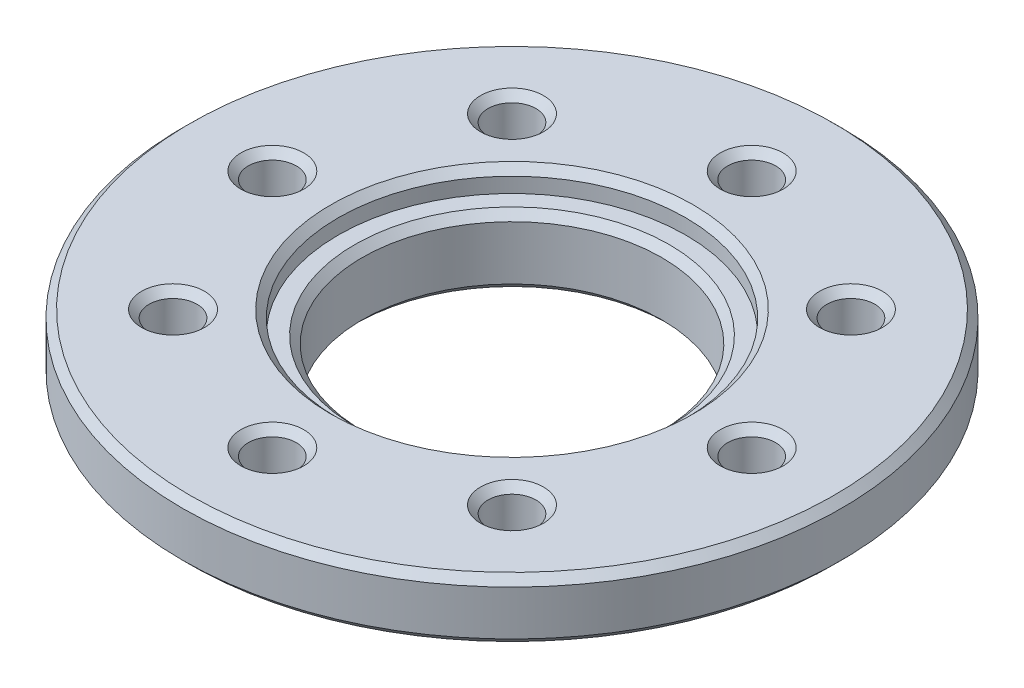
ISO-10303-21;
HEADER;
FILE_DESCRIPTION(('STEP AP214'),'2;1');
FILE_NAME('part.step','',(''),(''),'','','');
FILE_SCHEMA(('AUTOMOTIVE_DESIGN { 1 0 10303 214 1 1 1 1 }'));
ENDSEC;
DATA;
#1=APPLICATION_CONTEXT('core data for automotive mechanical design processes');
#2=APPLICATION_PROTOCOL_DEFINITION('international standard','automotive_design',2000,#1);
#3=PRODUCT_CONTEXT('',#1,'mechanical');
#4=PRODUCT('Part','Part','',(#3));
#5=PRODUCT_RELATED_PRODUCT_CATEGORY('part','',(#4));
#6=PRODUCT_DEFINITION_FORMATION('','',#4);
#7=PRODUCT_DEFINITION_CONTEXT('part definition',#1,'design');
#8=PRODUCT_DEFINITION('design','',#6,#7);
#9=PRODUCT_DEFINITION_SHAPE('','',#8);
#10=(LENGTH_UNIT() NAMED_UNIT(*) SI_UNIT(.MILLI.,.METRE.));
#11=(NAMED_UNIT(*) PLANE_ANGLE_UNIT() SI_UNIT($,.RADIAN.));
#12=(NAMED_UNIT(*) SI_UNIT($,.STERADIAN.) SOLID_ANGLE_UNIT());
#13=UNCERTAINTY_MEASURE_WITH_UNIT(LENGTH_MEASURE(1.E-05),#10,'distance_accuracy_value','');
#14=(GEOMETRIC_REPRESENTATION_CONTEXT(3) GLOBAL_UNCERTAINTY_ASSIGNED_CONTEXT((#13)) GLOBAL_UNIT_ASSIGNED_CONTEXT((#10,
#11,#12)) REPRESENTATION_CONTEXT('',''));
#15=CARTESIAN_POINT('',(0.,0.,0.));
#16=DIRECTION('',(0.,0.,1.));
#17=DIRECTION('',(1.,0.,0.));
#18=AXIS2_PLACEMENT_3D('',#15,#16,#17);
#19=CARTESIAN_POINT('',(0.,-2.,0.));
#20=DIRECTION('',(0.,-1.,0.));
#21=DIRECTION('',(0.,0.,-1.));
#22=AXIS2_PLACEMENT_3D('',#19,#20,#21);
#23=PLANE('',#22);
#24=CARTESIAN_POINT('',(0.,-2.,0.));
#25=DIRECTION('',(0.,-1.,0.));
#26=DIRECTION('',(0.,0.,-1.));
#27=AXIS2_PLACEMENT_3D('',#24,#25,#26);
#28=CIRCLE('',#27,10.7499999999956);
#29=CARTESIAN_POINT('',(0.,-2.,-10.7499999999956));
#30=VERTEX_POINT('',#29);
#31=EDGE_CURVE('E70',#30,#30,#28,.T.);
#32=ORIENTED_EDGE('',*,*,#31,.T.);
#33=EDGE_LOOP('',(#32));
#34=FACE_BOUND('',#33,.T.);
#35=CARTESIAN_POINT('',(0.,-2.,-8.));
#36=DIRECTION('',(0.,-1.,0.));
#37=DIRECTION('',(0.,0.,-1.));
#38=AXIS2_PLACEMENT_3D('',#35,#36,#37);
#39=CIRCLE('',#38,0.799999999999988);
#40=CARTESIAN_POINT('',(0.,-2.,-8.79999999999999));
#41=VERTEX_POINT('',#40);
#42=EDGE_CURVE('E125',#41,#41,#39,.T.);
#43=ORIENTED_EDGE('',*,*,#42,.F.);
#44=EDGE_LOOP('',(#43));
#45=FACE_BOUND('',#44,.T.);
#46=CARTESIAN_POINT('',(5.656854249492,-2.,-5.656854249492));
#47=DIRECTION('',(0.,-1.,0.));
#48=DIRECTION('',(0.,0.,-1.));
#49=AXIS2_PLACEMENT_3D('',#46,#47,#48);
#50=CIRCLE('',#49,0.799999999999988);
#51=CARTESIAN_POINT('',(5.656854249492,-2.,-6.45685424949199));
#52=VERTEX_POINT('',#51);
#53=EDGE_CURVE('E128',#52,#52,#50,.T.);
#54=ORIENTED_EDGE('',*,*,#53,.F.);
#55=EDGE_LOOP('',(#54));
#56=FACE_BOUND('',#55,.T.);
#57=CARTESIAN_POINT('',(8.,-2.,0.));
#58=DIRECTION('',(0.,-1.,0.));
#59=DIRECTION('',(0.,0.,-1.));
#60=AXIS2_PLACEMENT_3D('',#57,#58,#59);
#61=CIRCLE('',#60,0.799999999999988);
#62=CARTESIAN_POINT('',(8.,-2.,-0.799999999999988));
#63=VERTEX_POINT('',#62);
#64=EDGE_CURVE('E147',#63,#63,#61,.T.);
#65=ORIENTED_EDGE('',*,*,#64,.F.);
#66=EDGE_LOOP('',(#65));
#67=FACE_BOUND('',#66,.T.);
#68=CARTESIAN_POINT('',(5.656854249492,-2.,5.656854249492));
#69=DIRECTION('',(0.,-1.,0.));
#70=DIRECTION('',(0.,0.,-1.));
#71=AXIS2_PLACEMENT_3D('',#68,#69,#70);
#72=CIRCLE('',#71,0.799999999999988);
#73=CARTESIAN_POINT('',(5.656854249492,-2.,4.85685424949201));
#74=VERTEX_POINT('',#73);
#75=EDGE_CURVE('E144',#74,#74,#72,.T.);
#76=ORIENTED_EDGE('',*,*,#75,.F.);
#77=EDGE_LOOP('',(#76));
#78=FACE_BOUND('',#77,.T.);
#79=CARTESIAN_POINT('',(0.,-2.,8.));
#80=DIRECTION('',(0.,-1.,0.));
#81=DIRECTION('',(0.,0.,-1.));
#82=AXIS2_PLACEMENT_3D('',#79,#80,#81);
#83=CIRCLE('',#82,0.799999999999988);
#84=CARTESIAN_POINT('',(0.,-2.,7.20000000000001));
#85=VERTEX_POINT('',#84);
#86=EDGE_CURVE('E141',#85,#85,#83,.T.);
#87=ORIENTED_EDGE('',*,*,#86,.F.);
#88=EDGE_LOOP('',(#87));
#89=FACE_BOUND('',#88,.T.);
#90=CARTESIAN_POINT('',(-5.656854249492,-2.,5.656854249492));
#91=DIRECTION('',(0.,-1.,0.));
#92=DIRECTION('',(0.,0.,-1.));
#93=AXIS2_PLACEMENT_3D('',#90,#91,#92);
#94=CIRCLE('',#93,0.799999999999988);
#95=CARTESIAN_POINT('',(-5.656854249492,-2.,4.85685424949201));
#96=VERTEX_POINT('',#95);
#97=EDGE_CURVE('E138',#96,#96,#94,.T.);
#98=ORIENTED_EDGE('',*,*,#97,.F.);
#99=EDGE_LOOP('',(#98));
#100=FACE_BOUND('',#99,.T.);
#101=CARTESIAN_POINT('',(-8.,-2.,0.));
#102=DIRECTION('',(0.,-1.,0.));
#103=DIRECTION('',(0.,0.,-1.));
#104=AXIS2_PLACEMENT_3D('',#101,#102,#103);
#105=CIRCLE('',#104,0.799999999999988);
#106=CARTESIAN_POINT('',(-8.,-2.,-0.799999999999988));
#107=VERTEX_POINT('',#106);
#108=EDGE_CURVE('E135',#107,#107,#105,.T.);
#109=ORIENTED_EDGE('',*,*,#108,.F.);
#110=EDGE_LOOP('',(#109));
#111=FACE_BOUND('',#110,.T.);
#112=CARTESIAN_POINT('',(-5.656854249492,-2.,-5.656854249492));
#113=DIRECTION('',(0.,-1.,0.));
#114=DIRECTION('',(0.,0.,-1.));
#115=AXIS2_PLACEMENT_3D('',#112,#113,#114);
#116=CIRCLE('',#115,0.799999999999988);
#117=CARTESIAN_POINT('',(-5.656854249492,-2.,-6.45685424949199));
#118=VERTEX_POINT('',#117);
#119=EDGE_CURVE('E132',#118,#118,#116,.T.);
#120=ORIENTED_EDGE('',*,*,#119,.F.);
#121=EDGE_LOOP('',(#120));
#122=FACE_BOUND('',#121,.T.);
#123=CARTESIAN_POINT('',(0.,-2.,0.));
#124=DIRECTION('',(0.,-1.,0.));
#125=DIRECTION('',(0.,0.,-1.));
#126=AXIS2_PLACEMENT_3D('',#123,#124,#125);
#127=CIRCLE('',#126,6.25);
#128=CARTESIAN_POINT('',(0.,-2.,-6.25));
#129=VERTEX_POINT('',#128);
#130=EDGE_CURVE('E124',#129,#129,#127,.T.);
#131=ORIENTED_EDGE('',*,*,#130,.F.);
#132=EDGE_LOOP('',(#131));
#133=FACE_BOUND('',#132,.T.);
#134=ADVANCED_FACE('F32',(#34,#45,#56,#67,#78,#89,#100,#111,#122,#133),#23,.T.);
#135=CARTESIAN_POINT('',(0.,0.,0.));
#136=DIRECTION('',(0.,-1.,0.));
#137=DIRECTION('',(0.,0.,-1.));
#138=AXIS2_PLACEMENT_3D('',#135,#136,#137);
#139=CYLINDRICAL_SURFACE('',#138,11.);
#140=CARTESIAN_POINT('',(0.,-1.75000000005246,0.));
#141=DIRECTION('',(0.,-1.,0.));
#142=DIRECTION('',(0.,0.,-1.));
#143=AXIS2_PLACEMENT_3D('',#140,#141,#142);
#144=CIRCLE('',#143,11.);
#145=CARTESIAN_POINT('',(0.,-1.75000000005246,-11.));
#146=VERTEX_POINT('',#145);
#147=EDGE_CURVE('E64',#146,#146,#144,.F.);
#148=ORIENTED_EDGE('',*,*,#147,.T.);
#149=EDGE_LOOP('',(#148));
#150=FACE_BOUND('',#149,.T.);
#151=CARTESIAN_POINT('',(0.,-0.250000000004393,0.));
#152=DIRECTION('',(0.,1.,0.));
#153=DIRECTION('',(0.,0.,1.));
#154=AXIS2_PLACEMENT_3D('',#151,#152,#153);
#155=CIRCLE('',#154,11.);
#156=CARTESIAN_POINT('',(0.,-0.250000000004393,11.));
#157=VERTEX_POINT('',#156);
#158=EDGE_CURVE('E67',#157,#157,#155,.F.);
#159=ORIENTED_EDGE('',*,*,#158,.T.);
#160=EDGE_LOOP('',(#159));
#161=FACE_BOUND('',#160,.T.);
#162=ADVANCED_FACE('F172',(#150,#161),#139,.T.);
#163=CARTESIAN_POINT('',(11.,0.,0.));
#164=DIRECTION('',(0.,1.,0.));
#165=DIRECTION('',(0.,0.,1.));
#166=AXIS2_PLACEMENT_3D('',#163,#164,#165);
#167=PLANE('',#166);
#168=CARTESIAN_POINT('',(8.,0.,0.));
#169=DIRECTION('',(0.,1.,0.));
#170=DIRECTION('',(0.,0.,1.));
#171=AXIS2_PLACEMENT_3D('',#168,#169,#170);
#172=CIRCLE('',#171,1.04999999994754);
#173=CARTESIAN_POINT('',(8.,0.,1.04999999994754));
#174=VERTEX_POINT('',#173);
#175=EDGE_CURVE('E91',#174,#174,#172,.F.);
#176=ORIENTED_EDGE('',*,*,#175,.T.);
#177=EDGE_LOOP('',(#176));
#178=FACE_BOUND('',#177,.T.);
#179=CARTESIAN_POINT('',(-8.,0.,0.));
#180=DIRECTION('',(0.,1.,0.));
#181=DIRECTION('',(0.,0.,1.));
#182=AXIS2_PLACEMENT_3D('',#179,#180,#181);
#183=CIRCLE('',#182,1.04999999994754);
#184=CARTESIAN_POINT('',(-8.,0.,1.04999999994754));
#185=VERTEX_POINT('',#184);
#186=EDGE_CURVE('E94',#185,#185,#183,.F.);
#187=ORIENTED_EDGE('',*,*,#186,.T.);
#188=EDGE_LOOP('',(#187));
#189=FACE_BOUND('',#188,.T.);
#190=CARTESIAN_POINT('',(0.,0.,8.));
#191=DIRECTION('',(0.,1.,0.));
#192=DIRECTION('',(0.,0.,1.));
#193=AXIS2_PLACEMENT_3D('',#190,#191,#192);
#194=CIRCLE('',#193,1.04999999994754);
#195=CARTESIAN_POINT('',(0.,0.,9.04999999994754));
#196=VERTEX_POINT('',#195);
#197=EDGE_CURVE('E97',#196,#196,#194,.F.);
#198=ORIENTED_EDGE('',*,*,#197,.T.);
#199=EDGE_LOOP('',(#198));
#200=FACE_BOUND('',#199,.T.);
#201=CARTESIAN_POINT('',(0.,0.,0.));
#202=DIRECTION('',(0.,1.,0.));
#203=DIRECTION('',(0.,0.,1.));
#204=AXIS2_PLACEMENT_3D('',#201,#202,#203);
#205=CIRCLE('',#204,6.04999999994754);
#206=CARTESIAN_POINT('',(0.,0.,6.04999999994754));
#207=VERTEX_POINT('',#206);
#208=EDGE_CURVE('E100',#207,#207,#205,.F.);
#209=ORIENTED_EDGE('',*,*,#208,.T.);
#210=EDGE_LOOP('',(#209));
#211=FACE_BOUND('',#210,.T.);
#212=CARTESIAN_POINT('',(5.656854249492,0.,5.656854249492));
#213=DIRECTION('',(0.,1.,0.));
#214=DIRECTION('',(0.,0.,1.));
#215=AXIS2_PLACEMENT_3D('',#212,#213,#214);
#216=CIRCLE('',#215,1.04999999994754);
#217=CARTESIAN_POINT('',(5.656854249492,0.,6.70685424943954));
#218=VERTEX_POINT('',#217);
#219=EDGE_CURVE('E103',#218,#218,#216,.F.);
#220=ORIENTED_EDGE('',*,*,#219,.T.);
#221=EDGE_LOOP('',(#220));
#222=FACE_BOUND('',#221,.T.);
#223=CARTESIAN_POINT('',(0.,0.,0.));
#224=DIRECTION('',(0.,1.,0.));
#225=DIRECTION('',(0.,0.,1.));
#226=AXIS2_PLACEMENT_3D('',#223,#224,#225);
#227=CIRCLE('',#226,10.7500000000524);
#228=CARTESIAN_POINT('',(0.,0.,10.7500000000524));
#229=VERTEX_POINT('',#228);
#230=EDGE_CURVE('E106',#229,#229,#227,.T.);
#231=ORIENTED_EDGE('',*,*,#230,.T.);
#232=EDGE_LOOP('',(#231));
#233=FACE_BOUND('',#232,.T.);
#234=CARTESIAN_POINT('',(-5.656854249492,0.,5.656854249492));
#235=DIRECTION('',(0.,1.,0.));
#236=DIRECTION('',(0.,0.,1.));
#237=AXIS2_PLACEMENT_3D('',#234,#235,#236);
#238=CIRCLE('',#237,1.04999999994754);
#239=CARTESIAN_POINT('',(-5.656854249492,0.,6.70685424943954));
#240=VERTEX_POINT('',#239);
#241=EDGE_CURVE('E109',#240,#240,#238,.F.);
#242=ORIENTED_EDGE('',*,*,#241,.T.);
#243=EDGE_LOOP('',(#242));
#244=FACE_BOUND('',#243,.T.);
#245=CARTESIAN_POINT('',(-5.656854249492,0.,-5.656854249492));
#246=DIRECTION('',(0.,1.,0.));
#247=DIRECTION('',(0.,0.,1.));
#248=AXIS2_PLACEMENT_3D('',#245,#246,#247);
#249=CIRCLE('',#248,1.04999999994754);
#250=CARTESIAN_POINT('',(-5.656854249492,0.,-4.60685424954446));
#251=VERTEX_POINT('',#250);
#252=EDGE_CURVE('E112',#251,#251,#249,.F.);
#253=ORIENTED_EDGE('',*,*,#252,.T.);
#254=EDGE_LOOP('',(#253));
#255=FACE_BOUND('',#254,.T.);
#256=CARTESIAN_POINT('',(0.,0.,-8.));
#257=DIRECTION('',(0.,1.,0.));
#258=DIRECTION('',(0.,0.,1.));
#259=AXIS2_PLACEMENT_3D('',#256,#257,#258);
#260=CIRCLE('',#259,1.04999999994754);
#261=CARTESIAN_POINT('',(0.,0.,-6.95000000005246));
#262=VERTEX_POINT('',#261);
#263=EDGE_CURVE('E115',#262,#262,#260,.F.);
#264=ORIENTED_EDGE('',*,*,#263,.T.);
#265=EDGE_LOOP('',(#264));
#266=FACE_BOUND('',#265,.T.);
#267=CARTESIAN_POINT('',(5.656854249492,0.,-5.656854249492));
#268=DIRECTION('',(0.,1.,0.));
#269=DIRECTION('',(0.,0.,1.));
#270=AXIS2_PLACEMENT_3D('',#267,#268,#269);
#271=CIRCLE('',#270,1.04999999994754);
#272=CARTESIAN_POINT('',(5.656854249492,0.,-4.60685424954446));
#273=VERTEX_POINT('',#272);
#274=EDGE_CURVE('E118',#273,#273,#271,.F.);
#275=ORIENTED_EDGE('',*,*,#274,.T.);
#276=EDGE_LOOP('',(#275));
#277=FACE_BOUND('',#276,.T.);
#278=ADVANCED_FACE('F178',(#178,#189,#200,#211,#222,#233,#244,#255,#266,#277),#167,.T.);
#279=CARTESIAN_POINT('',(0.,-3.05,0.));
#280=DIRECTION('',(0.,1.,0.));
#281=DIRECTION('',(0.,0.,1.));
#282=AXIS2_PLACEMENT_3D('',#279,#280,#281);
#283=CYLINDRICAL_SURFACE('',#282,6.25);
#284=CARTESIAN_POINT('',(0.,-2.80000000005244,0.));
#285=DIRECTION('',(0.,-1.,0.));
#286=DIRECTION('',(0.,0.,-1.));
#287=AXIS2_PLACEMENT_3D('',#284,#285,#286);
#288=CIRCLE('',#287,6.25);
#289=CARTESIAN_POINT('',(0.,-2.80000000005244,-6.25));
#290=VERTEX_POINT('',#289);
#291=EDGE_CURVE('E52',#290,#290,#288,.F.);
#292=ORIENTED_EDGE('',*,*,#291,.T.);
#293=EDGE_LOOP('',(#292));
#294=FACE_BOUND('',#293,.T.);
#295=ORIENTED_EDGE('',*,*,#130,.T.);
#296=EDGE_LOOP('',(#295));
#297=FACE_BOUND('',#296,.T.);
#298=ADVANCED_FACE('F184',(#294,#297),#283,.T.);
#299=CARTESIAN_POINT('',(0.,-3.05,0.));
#300=DIRECTION('',(0.,-1.,0.));
#301=DIRECTION('',(0.,0.,-1.));
#302=AXIS2_PLACEMENT_3D('',#299,#300,#301);
#303=PLANE('',#302);
#304=CARTESIAN_POINT('',(0.,-3.05,0.));
#305=DIRECTION('',(0.,-1.,0.));
#306=DIRECTION('',(0.,0.,-1.));
#307=AXIS2_PLACEMENT_3D('',#304,#305,#306);
#308=CIRCLE('',#307,5.25000000000441);
#309=CARTESIAN_POINT('',(0.,-3.05,-5.25000000000441));
#310=VERTEX_POINT('',#309);
#311=EDGE_CURVE('E79',#310,#310,#308,.F.);
#312=ORIENTED_EDGE('',*,*,#311,.T.);
#313=EDGE_LOOP('',(#312));
#314=FACE_BOUND('',#313,.T.);
#315=CARTESIAN_POINT('',(0.,-3.05,0.));
#316=DIRECTION('',(0.,-1.,0.));
#317=DIRECTION('',(0.,0.,-1.));
#318=AXIS2_PLACEMENT_3D('',#315,#316,#317);
#319=CIRCLE('',#318,5.9999999999956);
#320=CARTESIAN_POINT('',(0.,-3.05,-5.9999999999956));
#321=VERTEX_POINT('',#320);
#322=EDGE_CURVE('E82',#321,#321,#319,.T.);
#323=ORIENTED_EDGE('',*,*,#322,.T.);
#324=EDGE_LOOP('',(#323));
#325=FACE_BOUND('',#324,.T.);
#326=ADVANCED_FACE('F276',(#314,#325),#303,.T.);
#327=CARTESIAN_POINT('',(-5.656854249492,0.,-5.656854249492));
#328=DIRECTION('',(0.,1.,0.));
#329=DIRECTION('',(0.,0.,1.));
#330=AXIS2_PLACEMENT_3D('',#327,#328,#329);
#331=CYLINDRICAL_SURFACE('',#330,0.799999999999988);
#332=CARTESIAN_POINT('',(-5.656854249492,-0.250000000004392,-5.656854249492));
#333=DIRECTION('',(0.,1.,0.));
#334=DIRECTION('',(0.,0.,1.));
#335=AXIS2_PLACEMENT_3D('',#332,#333,#334);
#336=CIRCLE('',#335,0.799999999999988);
#337=CARTESIAN_POINT('',(-5.656854249492,-0.250000000004392,-4.85685424949201));
#338=VERTEX_POINT('',#337);
#339=EDGE_CURVE('E47',#338,#338,#336,.T.);
#340=ORIENTED_EDGE('',*,*,#339,.T.);
#341=EDGE_LOOP('',(#340));
#342=FACE_BOUND('',#341,.T.);
#343=ORIENTED_EDGE('',*,*,#119,.T.);
#344=EDGE_LOOP('',(#343));
#345=FACE_BOUND('',#344,.T.);
#346=ADVANCED_FACE('F273',(#342,#345),#331,.F.);
#347=CARTESIAN_POINT('',(-8.,0.,0.));
#348=DIRECTION('',(0.,1.,0.));
#349=DIRECTION('',(0.,0.,1.));
#350=AXIS2_PLACEMENT_3D('',#347,#348,#349);
#351=CYLINDRICAL_SURFACE('',#350,0.799999999999988);
#352=CARTESIAN_POINT('',(-8.,-0.250000000004392,0.));
#353=DIRECTION('',(0.,1.,0.));
#354=DIRECTION('',(0.,0.,1.));
#355=AXIS2_PLACEMENT_3D('',#352,#353,#354);
#356=CIRCLE('',#355,0.799999999999988);
#357=CARTESIAN_POINT('',(-8.,-0.250000000004392,0.799999999999988));
#358=VERTEX_POINT('',#357);
#359=EDGE_CURVE('E88',#358,#358,#356,.T.);
#360=ORIENTED_EDGE('',*,*,#359,.T.);
#361=EDGE_LOOP('',(#360));
#362=FACE_BOUND('',#361,.T.);
#363=ORIENTED_EDGE('',*,*,#108,.T.);
#364=EDGE_LOOP('',(#363));
#365=FACE_BOUND('',#364,.T.);
#366=ADVANCED_FACE('F269',(#362,#365),#351,.F.);
#367=CARTESIAN_POINT('',(-5.656854249492,0.,5.656854249492));
#368=DIRECTION('',(0.,1.,0.));
#369=DIRECTION('',(0.,0.,1.));
#370=AXIS2_PLACEMENT_3D('',#367,#368,#369);
#371=CYLINDRICAL_SURFACE('',#370,0.799999999999988);
#372=CARTESIAN_POINT('',(-5.656854249492,-0.250000000004392,5.656854249492));
#373=DIRECTION('',(0.,1.,0.));
#374=DIRECTION('',(0.,0.,1.));
#375=AXIS2_PLACEMENT_3D('',#372,#373,#374);
#376=CIRCLE('',#375,0.799999999999988);
#377=CARTESIAN_POINT('',(-5.656854249492,-0.250000000004392,6.45685424949199));
#378=VERTEX_POINT('',#377);
#379=EDGE_CURVE('E55',#378,#378,#376,.T.);
#380=ORIENTED_EDGE('',*,*,#379,.T.);
#381=EDGE_LOOP('',(#380));
#382=FACE_BOUND('',#381,.T.);
#383=ORIENTED_EDGE('',*,*,#97,.T.);
#384=EDGE_LOOP('',(#383));
#385=FACE_BOUND('',#384,.T.);
#386=ADVANCED_FACE('F265',(#382,#385),#371,.F.);
#387=CARTESIAN_POINT('',(0.,0.,8.));
#388=DIRECTION('',(0.,1.,0.));
#389=DIRECTION('',(0.,0.,1.));
#390=AXIS2_PLACEMENT_3D('',#387,#388,#389);
#391=CYLINDRICAL_SURFACE('',#390,0.799999999999988);
#392=CARTESIAN_POINT('',(0.,-0.250000000004392,8.));
#393=DIRECTION('',(0.,1.,0.));
#394=DIRECTION('',(0.,0.,1.));
#395=AXIS2_PLACEMENT_3D('',#392,#393,#394);
#396=CIRCLE('',#395,0.799999999999988);
#397=CARTESIAN_POINT('',(0.,-0.250000000004392,8.79999999999999));
#398=VERTEX_POINT('',#397);
#399=EDGE_CURVE('E85',#398,#398,#396,.T.);
#400=ORIENTED_EDGE('',*,*,#399,.T.);
#401=EDGE_LOOP('',(#400));
#402=FACE_BOUND('',#401,.T.);
#403=ORIENTED_EDGE('',*,*,#86,.T.);
#404=EDGE_LOOP('',(#403));
#405=FACE_BOUND('',#404,.T.);
#406=ADVANCED_FACE('F261',(#402,#405),#391,.F.);
#407=CARTESIAN_POINT('',(5.656854249492,0.,5.656854249492));
#408=DIRECTION('',(0.,1.,0.));
#409=DIRECTION('',(0.,0.,1.));
#410=AXIS2_PLACEMENT_3D('',#407,#408,#409);
#411=CYLINDRICAL_SURFACE('',#410,0.799999999999988);
#412=CARTESIAN_POINT('',(5.656854249492,-0.250000000004392,5.656854249492));
#413=DIRECTION('',(0.,1.,0.));
#414=DIRECTION('',(0.,0.,1.));
#415=AXIS2_PLACEMENT_3D('',#412,#413,#414);
#416=CIRCLE('',#415,0.799999999999988);
#417=CARTESIAN_POINT('',(5.656854249492,-0.250000000004392,6.45685424949199));
#418=VERTEX_POINT('',#417);
#419=EDGE_CURVE('E58',#418,#418,#416,.T.);
#420=ORIENTED_EDGE('',*,*,#419,.T.);
#421=EDGE_LOOP('',(#420));
#422=FACE_BOUND('',#421,.T.);
#423=ORIENTED_EDGE('',*,*,#75,.T.);
#424=EDGE_LOOP('',(#423));
#425=FACE_BOUND('',#424,.T.);
#426=ADVANCED_FACE('F257',(#422,#425),#411,.F.);
#427=CARTESIAN_POINT('',(8.,0.,0.));
#428=DIRECTION('',(0.,1.,0.));
#429=DIRECTION('',(0.,0.,1.));
#430=AXIS2_PLACEMENT_3D('',#427,#428,#429);
#431=CYLINDRICAL_SURFACE('',#430,0.799999999999988);
#432=CARTESIAN_POINT('',(8.,-0.250000000004392,0.));
#433=DIRECTION('',(0.,1.,0.));
#434=DIRECTION('',(0.,0.,1.));
#435=AXIS2_PLACEMENT_3D('',#432,#433,#434);
#436=CIRCLE('',#435,0.799999999999988);
#437=CARTESIAN_POINT('',(8.,-0.250000000004392,0.799999999999988));
#438=VERTEX_POINT('',#437);
#439=EDGE_CURVE('E121',#438,#438,#436,.T.);
#440=ORIENTED_EDGE('',*,*,#439,.T.);
#441=EDGE_LOOP('',(#440));
#442=FACE_BOUND('',#441,.T.);
#443=ORIENTED_EDGE('',*,*,#64,.T.);
#444=EDGE_LOOP('',(#443));
#445=FACE_BOUND('',#444,.T.);
#446=ADVANCED_FACE('F254',(#442,#445),#431,.F.);
#447=CARTESIAN_POINT('',(5.656854249492,0.,-5.656854249492));
#448=DIRECTION('',(0.,1.,0.));
#449=DIRECTION('',(0.,0.,1.));
#450=AXIS2_PLACEMENT_3D('',#447,#448,#449);
#451=CYLINDRICAL_SURFACE('',#450,0.799999999999988);
#452=CARTESIAN_POINT('',(5.656854249492,-0.250000000004392,-5.656854249492));
#453=DIRECTION('',(0.,1.,0.));
#454=DIRECTION('',(0.,0.,1.));
#455=AXIS2_PLACEMENT_3D('',#452,#453,#454);
#456=CIRCLE('',#455,0.799999999999988);
#457=CARTESIAN_POINT('',(5.656854249492,-0.250000000004392,-4.85685424949201));
#458=VERTEX_POINT('',#457);
#459=EDGE_CURVE('E10',#458,#458,#456,.T.);
#460=ORIENTED_EDGE('',*,*,#459,.T.);
#461=EDGE_LOOP('',(#460));
#462=FACE_BOUND('',#461,.T.);
#463=ORIENTED_EDGE('',*,*,#53,.T.);
#464=EDGE_LOOP('',(#463));
#465=FACE_BOUND('',#464,.T.);
#466=ADVANCED_FACE('F248',(#462,#465),#451,.F.);
#467=CARTESIAN_POINT('',(0.,0.,-8.));
#468=DIRECTION('',(0.,1.,0.));
#469=DIRECTION('',(0.,0.,1.));
#470=AXIS2_PLACEMENT_3D('',#467,#468,#469);
#471=CYLINDRICAL_SURFACE('',#470,0.799999999999988);
#472=CARTESIAN_POINT('',(0.,-0.250000000004392,-8.));
#473=DIRECTION('',(0.,1.,0.));
#474=DIRECTION('',(0.,0.,1.));
#475=AXIS2_PLACEMENT_3D('',#472,#473,#474);
#476=CIRCLE('',#475,0.799999999999988);
#477=CARTESIAN_POINT('',(0.,-0.250000000004392,-7.20000000000001));
#478=VERTEX_POINT('',#477);
#479=EDGE_CURVE('E43',#478,#478,#476,.T.);
#480=ORIENTED_EDGE('',*,*,#479,.T.);
#481=EDGE_LOOP('',(#480));
#482=FACE_BOUND('',#481,.T.);
#483=ORIENTED_EDGE('',*,*,#42,.T.);
#484=EDGE_LOOP('',(#483));
#485=FACE_BOUND('',#484,.T.);
#486=ADVANCED_FACE('F242',(#482,#485),#471,.F.);
#487=CARTESIAN_POINT('',(0.,0.,0.));
#488=DIRECTION('',(0.,1.,0.));
#489=DIRECTION('',(0.,0.,1.));
#490=AXIS2_PLACEMENT_3D('',#487,#488,#489);
#491=CYLINDRICAL_SURFACE('',#490,5.00000000000001);
#492=CARTESIAN_POINT('',(0.,-2.80000000005244,0.));
#493=DIRECTION('',(0.,-1.,0.));
#494=DIRECTION('',(0.,0.,-1.));
#495=AXIS2_PLACEMENT_3D('',#492,#493,#494);
#496=CIRCLE('',#495,5.00000000000001);
#497=CARTESIAN_POINT('',(0.,-2.80000000005244,-5.00000000000001));
#498=VERTEX_POINT('',#497);
#499=EDGE_CURVE('E73',#498,#498,#496,.T.);
#500=ORIENTED_EDGE('',*,*,#499,.T.);
#501=EDGE_LOOP('',(#500));
#502=FACE_BOUND('',#501,.T.);
#503=CARTESIAN_POINT('',(0.,-1.00000000000439,0.));
#504=DIRECTION('',(0.,-1.,0.));
#505=DIRECTION('',(0.,0.,-1.));
#506=AXIS2_PLACEMENT_3D('',#503,#504,#505);
#507=CIRCLE('',#506,5.00000000000001);
#508=CARTESIAN_POINT('',(0.,-1.00000000000439,-5.00000000000001));
#509=VERTEX_POINT('',#508);
#510=EDGE_CURVE('E76',#509,#509,#507,.F.);
#511=ORIENTED_EDGE('',*,*,#510,.T.);
#512=EDGE_LOOP('',(#511));
#513=FACE_BOUND('',#512,.T.);
#514=ADVANCED_FACE('F169',(#502,#513),#491,.F.);
#515=CARTESIAN_POINT('',(5.00000000000001,-0.750000000000001,0.));
#516=DIRECTION('',(0.,-1.,0.));
#517=DIRECTION('',(0.,0.,-1.));
#518=AXIS2_PLACEMENT_3D('',#515,#516,#517);
#519=PLANE('',#518);
#520=CARTESIAN_POINT('',(0.,-0.750000000000001,0.));
#521=DIRECTION('',(0.,-1.,0.));
#522=DIRECTION('',(0.,0.,-1.));
#523=AXIS2_PLACEMENT_3D('',#520,#521,#522);
#524=CIRCLE('',#523,5.24999999994756);
#525=CARTESIAN_POINT('',(0.,-0.750000000000001,-5.24999999994756));
#526=VERTEX_POINT('',#525);
#527=EDGE_CURVE('E39',#526,#526,#524,.T.);
#528=ORIENTED_EDGE('',*,*,#527,.T.);
#529=EDGE_LOOP('',(#528));
#530=FACE_BOUND('',#529,.T.);
#531=CARTESIAN_POINT('',(0.,-0.750000000000001,0.));
#532=DIRECTION('',(0.,1.,0.));
#533=DIRECTION('',(0.,0.,1.));
#534=AXIS2_PLACEMENT_3D('',#531,#532,#533);
#535=CIRCLE('',#534,5.8);
#536=CARTESIAN_POINT('',(0.,-0.750000000000001,5.8));
#537=VERTEX_POINT('',#536);
#538=EDGE_CURVE('E129',#537,#537,#535,.T.);
#539=ORIENTED_EDGE('',*,*,#538,.T.);
#540=EDGE_LOOP('',(#539));
#541=FACE_BOUND('',#540,.T.);
#542=ADVANCED_FACE('F155',(#530,#541),#519,.F.);
#543=CARTESIAN_POINT('',(0.,0.,0.));
#544=DIRECTION('',(0.,1.,0.));
#545=DIRECTION('',(0.,0.,1.));
#546=AXIS2_PLACEMENT_3D('',#543,#544,#545);
#547=CYLINDRICAL_SURFACE('',#546,5.8);
#548=CARTESIAN_POINT('',(0.,-0.250000000004392,0.));
#549=DIRECTION('',(0.,1.,0.));
#550=DIRECTION('',(0.,0.,1.));
#551=AXIS2_PLACEMENT_3D('',#548,#549,#550);
#552=CIRCLE('',#551,5.8);
#553=CARTESIAN_POINT('',(0.,-0.250000000004392,5.8));
#554=VERTEX_POINT('',#553);
#555=EDGE_CURVE('E61',#554,#554,#552,.T.);
#556=ORIENTED_EDGE('',*,*,#555,.T.);
#557=EDGE_LOOP('',(#556));
#558=FACE_BOUND('',#557,.T.);
#559=ORIENTED_EDGE('',*,*,#538,.F.);
#560=EDGE_LOOP('',(#559));
#561=FACE_BOUND('',#560,.T.);
#562=ADVANCED_FACE('F157',(#558,#561),#547,.F.);
#563=CARTESIAN_POINT('',(8.,-0.250000000004392,0.));
#564=DIRECTION('',(0.,1.,0.));
#565=DIRECTION('',(0.,0.,1.));
#566=AXIS2_PLACEMENT_3D('',#563,#564,#565);
#567=CONICAL_SURFACE('',#566,0.799999999999988,0.785398163283763);
#568=ORIENTED_EDGE('',*,*,#175,.F.);
#569=EDGE_LOOP('',(#568));
#570=FACE_BOUND('',#569,.T.);
#571=ORIENTED_EDGE('',*,*,#439,.F.);
#572=EDGE_LOOP('',(#571));
#573=FACE_BOUND('',#572,.T.);
#574=ADVANCED_FACE('F159',(#570,#573),#567,.F.);
#575=CARTESIAN_POINT('',(-8.,-0.250000000004392,0.));
#576=DIRECTION('',(0.,1.,0.));
#577=DIRECTION('',(0.,0.,1.));
#578=AXIS2_PLACEMENT_3D('',#575,#576,#577);
#579=CONICAL_SURFACE('',#578,0.799999999999988,0.785398163283763);
#580=ORIENTED_EDGE('',*,*,#186,.F.);
#581=EDGE_LOOP('',(#580));
#582=FACE_BOUND('',#581,.T.);
#583=ORIENTED_EDGE('',*,*,#359,.F.);
#584=EDGE_LOOP('',(#583));
#585=FACE_BOUND('',#584,.T.);
#586=ADVANCED_FACE('F166',(#582,#585),#579,.F.);
#587=CARTESIAN_POINT('',(0.,-0.250000000004392,8.));
#588=DIRECTION('',(0.,1.,0.));
#589=DIRECTION('',(0.,0.,1.));
#590=AXIS2_PLACEMENT_3D('',#587,#588,#589);
#591=CONICAL_SURFACE('',#590,0.799999999999988,0.785398163283763);
#592=ORIENTED_EDGE('',*,*,#197,.F.);
#593=EDGE_LOOP('',(#592));
#594=FACE_BOUND('',#593,.T.);
#595=ORIENTED_EDGE('',*,*,#399,.F.);
#596=EDGE_LOOP('',(#595));
#597=FACE_BOUND('',#596,.T.);
#598=ADVANCED_FACE('F191',(#594,#597),#591,.F.);
#599=CARTESIAN_POINT('',(0.,-3.05,0.));
#600=DIRECTION('',(0.,-1.,0.));
#601=DIRECTION('',(0.,0.,-1.));
#602=AXIS2_PLACEMENT_3D('',#599,#600,#601);
#603=CONICAL_SURFACE('',#602,5.25000000000441,0.785398163511128);
#604=ORIENTED_EDGE('',*,*,#499,.F.);
#605=EDGE_LOOP('',(#604));
#606=FACE_BOUND('',#605,.T.);
#607=ORIENTED_EDGE('',*,*,#311,.F.);
#608=EDGE_LOOP('',(#607));
#609=FACE_BOUND('',#608,.T.);
#610=ADVANCED_FACE('F195',(#606,#609),#603,.F.);
#611=CARTESIAN_POINT('',(0.,-2.,0.));
#612=DIRECTION('',(0.,1.,0.));
#613=DIRECTION('',(0.,0.,1.));
#614=AXIS2_PLACEMENT_3D('',#611,#612,#613);
#615=CONICAL_SURFACE('',#614,10.7499999999956,0.785398163511132);
#616=ORIENTED_EDGE('',*,*,#147,.F.);
#617=EDGE_LOOP('',(#616));
#618=FACE_BOUND('',#617,.T.);
#619=ORIENTED_EDGE('',*,*,#31,.F.);
#620=EDGE_LOOP('',(#619));
#621=FACE_BOUND('',#620,.T.);
#622=ADVANCED_FACE('F199',(#618,#621),#615,.T.);
#623=CARTESIAN_POINT('',(0.,-0.250000000004392,0.));
#624=DIRECTION('',(0.,1.,0.));
#625=DIRECTION('',(0.,0.,1.));
#626=AXIS2_PLACEMENT_3D('',#623,#624,#625);
#627=CONICAL_SURFACE('',#626,5.8,0.785398163283763);
#628=ORIENTED_EDGE('',*,*,#208,.F.);
#629=EDGE_LOOP('',(#628));
#630=FACE_BOUND('',#629,.T.);
#631=ORIENTED_EDGE('',*,*,#555,.F.);
#632=EDGE_LOOP('',(#631));
#633=FACE_BOUND('',#632,.T.);
#634=ADVANCED_FACE('F203',(#630,#633),#627,.F.);
#635=CARTESIAN_POINT('',(5.656854249492,-0.250000000004392,5.656854249492));
#636=DIRECTION('',(0.,1.,0.));
#637=DIRECTION('',(0.,0.,1.));
#638=AXIS2_PLACEMENT_3D('',#635,#636,#637);
#639=CONICAL_SURFACE('',#638,0.799999999999988,0.785398163283761);
#640=ORIENTED_EDGE('',*,*,#219,.F.);
#641=EDGE_LOOP('',(#640));
#642=FACE_BOUND('',#641,.T.);
#643=ORIENTED_EDGE('',*,*,#419,.F.);
#644=EDGE_LOOP('',(#643));
#645=FACE_BOUND('',#644,.T.);
#646=ADVANCED_FACE('F207',(#642,#645),#639,.F.);
#647=CARTESIAN_POINT('',(0.,-0.250000000004393,0.));
#648=DIRECTION('',(0.,-1.,0.));
#649=DIRECTION('',(0.,0.,-1.));
#650=AXIS2_PLACEMENT_3D('',#647,#648,#649);
#651=CONICAL_SURFACE('',#650,11.,0.785398163283772);
#652=ORIENTED_EDGE('',*,*,#230,.F.);
#653=EDGE_LOOP('',(#652));
#654=FACE_BOUND('',#653,.T.);
#655=ORIENTED_EDGE('',*,*,#158,.F.);
#656=EDGE_LOOP('',(#655));
#657=FACE_BOUND('',#656,.T.);
#658=ADVANCED_FACE('F211',(#654,#657),#651,.T.);
#659=CARTESIAN_POINT('',(-5.656854249492,-0.250000000004392,5.656854249492));
#660=DIRECTION('',(0.,1.,0.));
#661=DIRECTION('',(0.,0.,1.));
#662=AXIS2_PLACEMENT_3D('',#659,#660,#661);
#663=CONICAL_SURFACE('',#662,0.799999999999988,0.785398163283761);
#664=ORIENTED_EDGE('',*,*,#241,.F.);
#665=EDGE_LOOP('',(#664));
#666=FACE_BOUND('',#665,.T.);
#667=ORIENTED_EDGE('',*,*,#379,.F.);
#668=EDGE_LOOP('',(#667));
#669=FACE_BOUND('',#668,.T.);
#670=ADVANCED_FACE('F215',(#666,#669),#663,.F.);
#671=CARTESIAN_POINT('',(0.,-3.05,0.));
#672=DIRECTION('',(0.,1.,0.));
#673=DIRECTION('',(0.,0.,1.));
#674=AXIS2_PLACEMENT_3D('',#671,#672,#673);
#675=CONICAL_SURFACE('',#674,5.9999999999956,0.785398163511133);
#676=ORIENTED_EDGE('',*,*,#291,.F.);
#677=EDGE_LOOP('',(#676));
#678=FACE_BOUND('',#677,.T.);
#679=ORIENTED_EDGE('',*,*,#322,.F.);
#680=EDGE_LOOP('',(#679));
#681=FACE_BOUND('',#680,.T.);
#682=ADVANCED_FACE('F219',(#678,#681),#675,.T.);
#683=CARTESIAN_POINT('',(-5.656854249492,-0.250000000004392,-5.656854249492));
#684=DIRECTION('',(0.,1.,0.));
#685=DIRECTION('',(0.,0.,1.));
#686=AXIS2_PLACEMENT_3D('',#683,#684,#685);
#687=CONICAL_SURFACE('',#686,0.799999999999988,0.785398163283761);
#688=ORIENTED_EDGE('',*,*,#252,.F.);
#689=EDGE_LOOP('',(#688));
#690=FACE_BOUND('',#689,.T.);
#691=ORIENTED_EDGE('',*,*,#339,.F.);
#692=EDGE_LOOP('',(#691));
#693=FACE_BOUND('',#692,.T.);
#694=ADVANCED_FACE('F223',(#690,#693),#687,.F.);
#695=CARTESIAN_POINT('',(0.,-0.250000000004392,-8.));
#696=DIRECTION('',(0.,1.,0.));
#697=DIRECTION('',(0.,0.,1.));
#698=AXIS2_PLACEMENT_3D('',#695,#696,#697);
#699=CONICAL_SURFACE('',#698,0.799999999999988,0.785398163283763);
#700=ORIENTED_EDGE('',*,*,#263,.F.);
#701=EDGE_LOOP('',(#700));
#702=FACE_BOUND('',#701,.T.);
#703=ORIENTED_EDGE('',*,*,#479,.F.);
#704=EDGE_LOOP('',(#703));
#705=FACE_BOUND('',#704,.T.);
#706=ADVANCED_FACE('F227',(#702,#705),#699,.F.);
#707=CARTESIAN_POINT('',(0.,-1.00000000000439,0.));
#708=DIRECTION('',(0.,1.,0.));
#709=DIRECTION('',(0.,0.,1.));
#710=AXIS2_PLACEMENT_3D('',#707,#708,#709);
#711=CONICAL_SURFACE('',#710,5.00000000000001,0.785398163283768);
#712=ORIENTED_EDGE('',*,*,#527,.F.);
#713=EDGE_LOOP('',(#712));
#714=FACE_BOUND('',#713,.T.);
#715=ORIENTED_EDGE('',*,*,#510,.F.);
#716=EDGE_LOOP('',(#715));
#717=FACE_BOUND('',#716,.T.);
#718=ADVANCED_FACE('F230',(#714,#717),#711,.F.);
#719=CARTESIAN_POINT('',(5.656854249492,-0.250000000004392,-5.656854249492));
#720=DIRECTION('',(0.,1.,0.));
#721=DIRECTION('',(0.,0.,1.));
#722=AXIS2_PLACEMENT_3D('',#719,#720,#721);
#723=CONICAL_SURFACE('',#722,0.799999999999988,0.785398163283761);
#724=ORIENTED_EDGE('',*,*,#274,.F.);
#725=EDGE_LOOP('',(#724));
#726=FACE_BOUND('',#725,.T.);
#727=ORIENTED_EDGE('',*,*,#459,.F.);
#728=EDGE_LOOP('',(#727));
#729=FACE_BOUND('',#728,.T.);
#730=ADVANCED_FACE('F34',(#726,#729),#723,.F.);
#731=CLOSED_SHELL('',(#134,#162,#278,#298,#326,#346,#366,#386,#406,#426,#446,#466,#486,#514,
#542,#562,#574,#586,#598,#610,#622,#634,#646,#658,#670,#682,#694,#706,#718,#730));
#732=MANIFOLD_SOLID_BREP('B2',#731);
#733=ADVANCED_BREP_SHAPE_REPRESENTATION('',(#18,#732),#14);
#734=SHAPE_DEFINITION_REPRESENTATION(#9,#733);
ENDSEC;
END-ISO-10303-21;
